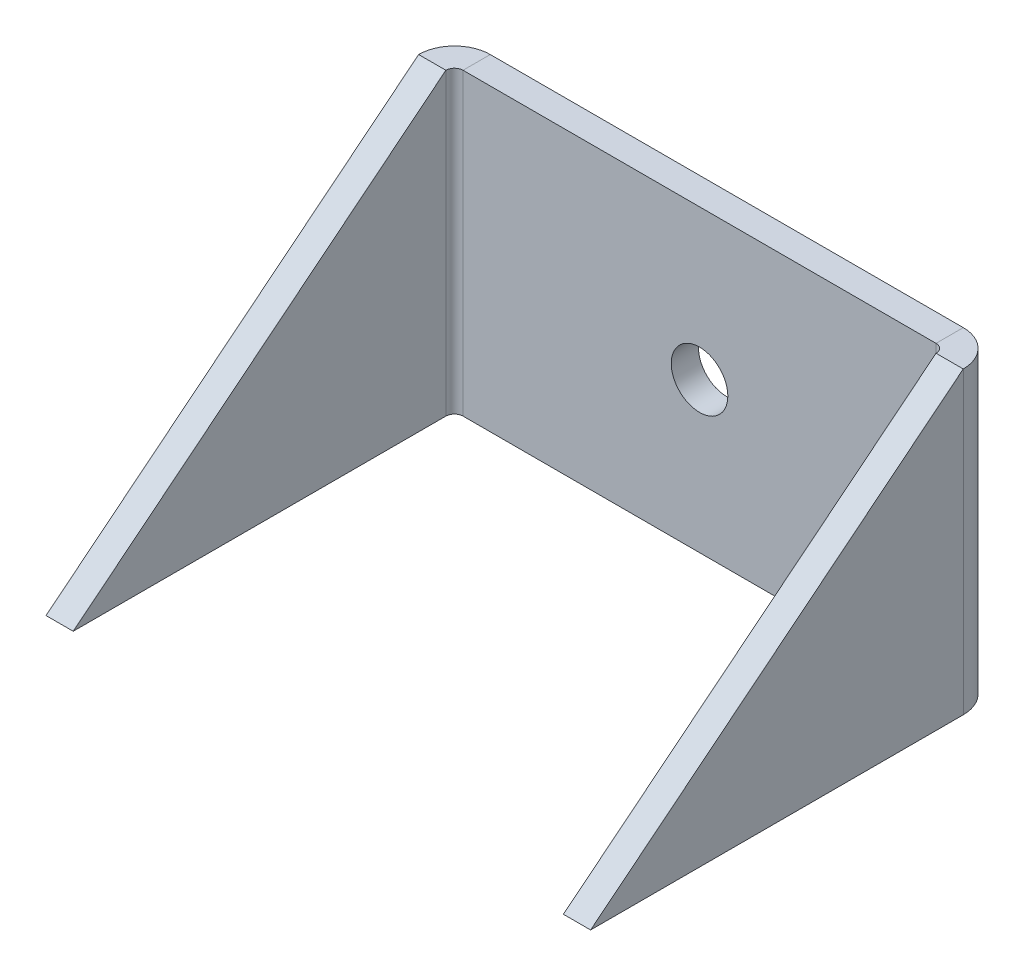
ISO-10303-21;
HEADER;
FILE_DESCRIPTION(('STEP AP214'),'2;1');
FILE_NAME('part.step','',(''),(''),'','','');
FILE_SCHEMA(('AUTOMOTIVE_DESIGN { 1 0 10303 214 1 1 1 1 }'));
ENDSEC;
DATA;
#1=APPLICATION_CONTEXT('core data for automotive mechanical design processes');
#2=APPLICATION_PROTOCOL_DEFINITION('international standard','automotive_design',2000,#1);
#3=PRODUCT_CONTEXT('',#1,'mechanical');
#4=PRODUCT('Part','Part','',(#3));
#5=PRODUCT_RELATED_PRODUCT_CATEGORY('part','',(#4));
#6=PRODUCT_DEFINITION_FORMATION('','',#4);
#7=PRODUCT_DEFINITION_CONTEXT('part definition',#1,'design');
#8=PRODUCT_DEFINITION('design','',#6,#7);
#9=PRODUCT_DEFINITION_SHAPE('','',#8);
#10=(LENGTH_UNIT() NAMED_UNIT(*) SI_UNIT(.MILLI.,.METRE.));
#11=(NAMED_UNIT(*) PLANE_ANGLE_UNIT() SI_UNIT($,.RADIAN.));
#12=(NAMED_UNIT(*) SI_UNIT($,.STERADIAN.) SOLID_ANGLE_UNIT());
#13=UNCERTAINTY_MEASURE_WITH_UNIT(LENGTH_MEASURE(1.E-05),#10,'distance_accuracy_value','');
#14=(GEOMETRIC_REPRESENTATION_CONTEXT(3) GLOBAL_UNCERTAINTY_ASSIGNED_CONTEXT((#13)) GLOBAL_UNIT_ASSIGNED_CONTEXT((#10,
#11,#12)) REPRESENTATION_CONTEXT('',''));
#15=CARTESIAN_POINT('',(0.,0.,0.));
#16=DIRECTION('',(0.,0.,1.));
#17=DIRECTION('',(1.,0.,0.));
#18=AXIS2_PLACEMENT_3D('',#15,#16,#17);
#19=CARTESIAN_POINT('',(-31.75,0.,-1.11451597218056E-13));
#20=DIRECTION('',(1.,0.,0.));
#21=DIRECTION('',(0.,0.,1.));
#22=AXIS2_PLACEMENT_3D('',#19,#20,#21);
#23=PLANE('',#22);
#24=DIRECTION('',(0.,0.626498155753381,-0.77942290243334));
#25=VECTOR('',#24,1.);
#26=CARTESIAN_POINT('',(-31.75,17.4625,4.17499999999998));
#27=LINE('',#26,#25);
#28=CARTESIAN_POINT('',(-31.7500000000002,-17.4625,47.625));
#29=VERTEX_POINT('',#28);
#30=CARTESIAN_POINT('',(-31.75,17.4625,4.17499999999998));
#31=VERTEX_POINT('',#30);
#32=EDGE_CURVE('E128',#29,#31,#27,.T.);
#33=ORIENTED_EDGE('',*,*,#32,.T.);
#34=DIRECTION('',(0.,1.,0.));
#35=VECTOR('',#34,1.);
#36=CARTESIAN_POINT('',(-31.75,0.,4.17499999999998));
#37=LINE('',#36,#35);
#38=CARTESIAN_POINT('',(-31.75,-17.4625,4.17499999999999));
#39=VERTEX_POINT('',#38);
#40=EDGE_CURVE('E151',#39,#31,#37,.T.);
#41=ORIENTED_EDGE('',*,*,#40,.F.);
#42=DIRECTION('',(0.,0.,-1.));
#43=VECTOR('',#42,1.);
#44=CARTESIAN_POINT('',(-31.75,-17.4625,3.17499999999999));
#45=LINE('',#44,#43);
#46=EDGE_CURVE('E157',#29,#39,#45,.T.);
#47=ORIENTED_EDGE('',*,*,#46,.F.);
#48=EDGE_LOOP('',(#33,#41,#47));
#49=FACE_BOUND('',#48,.T.);
#50=ADVANCED_FACE('F38',(#49),#23,.F.);
#51=CARTESIAN_POINT('',(-28.575,0.,-1.00366143967229E-13));
#52=DIRECTION('',(1.,0.,0.));
#53=DIRECTION('',(0.,0.,1.));
#54=AXIS2_PLACEMENT_3D('',#51,#52,#53);
#55=PLANE('',#54);
#56=DIRECTION('',(0.,-1.,0.));
#57=VECTOR('',#56,1.);
#58=CARTESIAN_POINT('',(-28.575,17.4625,4.17499999999999));
#59=LINE('',#58,#57);
#60=CARTESIAN_POINT('',(-28.575,17.4625,4.17499999999999));
#61=VERTEX_POINT('',#60);
#62=CARTESIAN_POINT('',(-28.575,-17.4625,4.175));
#63=VERTEX_POINT('',#62);
#64=EDGE_CURVE('E138',#61,#63,#59,.T.);
#65=ORIENTED_EDGE('',*,*,#64,.F.);
#66=DIRECTION('',(0.,0.626498155753381,-0.77942290243334));
#67=VECTOR('',#66,1.);
#68=CARTESIAN_POINT('',(-28.575,17.4625,4.17499999999999));
#69=LINE('',#68,#67);
#70=CARTESIAN_POINT('',(-28.5750000000001,-17.4625,47.625));
#71=VERTEX_POINT('',#70);
#72=EDGE_CURVE('E117',#71,#61,#69,.T.);
#73=ORIENTED_EDGE('',*,*,#72,.F.);
#74=DIRECTION('',(0.,0.,-1.));
#75=VECTOR('',#74,1.);
#76=CARTESIAN_POINT('',(-28.575,-17.4625,3.175));
#77=LINE('',#76,#75);
#78=EDGE_CURVE('E147',#71,#63,#77,.T.);
#79=ORIENTED_EDGE('',*,*,#78,.T.);
#80=EDGE_LOOP('',(#65,#73,#79));
#81=FACE_BOUND('',#80,.T.);
#82=ADVANCED_FACE('F146',(#81),#55,.T.);
#83=CARTESIAN_POINT('',(-28.575,17.4625,3.175));
#84=DIRECTION('',(0.,-1.,0.));
#85=DIRECTION('',(0.,0.,-1.));
#86=AXIS2_PLACEMENT_3D('',#83,#84,#85);
#87=PLANE('',#86);
#88=DIRECTION('',(0.,0.,-1.));
#89=VECTOR('',#88,1.);
#90=CARTESIAN_POINT('',(-27.575,17.4625,3.175));
#91=LINE('',#90,#89);
#92=CARTESIAN_POINT('',(-27.575,17.4625,3.175));
#93=VERTEX_POINT('',#92);
#94=CARTESIAN_POINT('',(-27.575,17.4625,0.));
#95=VERTEX_POINT('',#94);
#96=EDGE_CURVE('E55',#93,#95,#91,.T.);
#97=ORIENTED_EDGE('',*,*,#96,.F.);
#98=DIRECTION('',(-1.,0.,0.));
#99=VECTOR('',#98,1.);
#100=CARTESIAN_POINT('',(-28.575,17.4625,3.175));
#101=LINE('',#100,#99);
#102=CARTESIAN_POINT('',(27.575,17.4625,3.175));
#103=VERTEX_POINT('',#102);
#104=EDGE_CURVE('E47',#103,#93,#101,.T.);
#105=ORIENTED_EDGE('',*,*,#104,.F.);
#106=DIRECTION('',(0.,0.,-1.));
#107=VECTOR('',#106,1.);
#108=CARTESIAN_POINT('',(27.575,17.4625,3.17499999999999));
#109=LINE('',#108,#107);
#110=CARTESIAN_POINT('',(27.575,17.4625,0.));
#111=VERTEX_POINT('',#110);
#112=EDGE_CURVE('E206',#103,#111,#109,.T.);
#113=ORIENTED_EDGE('',*,*,#112,.T.);
#114=DIRECTION('',(-1.,0.,0.));
#115=VECTOR('',#114,1.);
#116=CARTESIAN_POINT('',(-28.575,17.4625,0.));
#117=LINE('',#116,#115);
#118=EDGE_CURVE('E220',#111,#95,#117,.T.);
#119=ORIENTED_EDGE('',*,*,#118,.T.);
#120=EDGE_LOOP('',(#97,#105,#113,#119));
#121=FACE_BOUND('',#120,.T.);
#122=ADVANCED_FACE('F40',(#121),#87,.F.);
#123=CARTESIAN_POINT('',(-28.575,-17.4625,3.175));
#124=DIRECTION('',(0.,1.,0.));
#125=DIRECTION('',(0.,0.,1.));
#126=AXIS2_PLACEMENT_3D('',#123,#124,#125);
#127=PLANE('',#126);
#128=DIRECTION('',(0.,0.,-1.));
#129=VECTOR('',#128,1.);
#130=CARTESIAN_POINT('',(-27.575,-17.4625,3.175));
#131=LINE('',#130,#129);
#132=CARTESIAN_POINT('',(-27.575,-17.4625,3.175));
#133=VERTEX_POINT('',#132);
#134=CARTESIAN_POINT('',(-27.575,-17.4625,0.));
#135=VERTEX_POINT('',#134);
#136=EDGE_CURVE('E166',#133,#135,#131,.T.);
#137=ORIENTED_EDGE('',*,*,#136,.T.);
#138=DIRECTION('',(1.,0.,0.));
#139=VECTOR('',#138,1.);
#140=CARTESIAN_POINT('',(-28.575,-17.4625,0.));
#141=LINE('',#140,#139);
#142=CARTESIAN_POINT('',(27.575,-17.4625,0.));
#143=VERTEX_POINT('',#142);
#144=EDGE_CURVE('E42',#135,#143,#141,.T.);
#145=ORIENTED_EDGE('',*,*,#144,.T.);
#146=DIRECTION('',(0.,0.,-1.));
#147=VECTOR('',#146,1.);
#148=CARTESIAN_POINT('',(27.575,-17.4625,3.17499999999999));
#149=LINE('',#148,#147);
#150=CARTESIAN_POINT('',(27.575,-17.4625,3.175));
#151=VERTEX_POINT('',#150);
#152=EDGE_CURVE('E217',#151,#143,#149,.T.);
#153=ORIENTED_EDGE('',*,*,#152,.F.);
#154=DIRECTION('',(1.,0.,0.));
#155=VECTOR('',#154,1.);
#156=CARTESIAN_POINT('',(-28.575,-17.4625,3.175));
#157=LINE('',#156,#155);
#158=EDGE_CURVE('E11',#133,#151,#157,.T.);
#159=ORIENTED_EDGE('',*,*,#158,.F.);
#160=EDGE_LOOP('',(#137,#145,#153,#159));
#161=FACE_BOUND('',#160,.T.);
#162=ADVANCED_FACE('F226',(#161),#127,.F.);
#163=CARTESIAN_POINT('',(0.,0.,3.175));
#164=DIRECTION('',(0.,0.,1.));
#165=DIRECTION('',(1.,0.,0.));
#166=AXIS2_PLACEMENT_3D('',#163,#164,#165);
#167=PLANE('',#166);
#168=CARTESIAN_POINT('',(0.,0.,3.175));
#169=DIRECTION('',(0.,0.,1.));
#170=DIRECTION('',(1.,0.,0.));
#171=AXIS2_PLACEMENT_3D('',#168,#169,#170);
#172=CIRCLE('',#171,3.29999999999999);
#173=CARTESIAN_POINT('',(3.29999999999999,0.,3.175));
#174=VERTEX_POINT('',#173);
#175=EDGE_CURVE('E296',#174,#174,#172,.T.);
#176=ORIENTED_EDGE('',*,*,#175,.F.);
#177=EDGE_LOOP('',(#176));
#178=FACE_BOUND('',#177,.T.);
#179=ORIENTED_EDGE('',*,*,#104,.T.);
#180=DIRECTION('',(0.,-1.,0.));
#181=VECTOR('',#180,1.);
#182=CARTESIAN_POINT('',(-27.575,-17.4625,3.175));
#183=LINE('',#182,#181);
#184=EDGE_CURVE('E61',#133,#93,#183,.F.);
#185=ORIENTED_EDGE('',*,*,#184,.F.);
#186=ORIENTED_EDGE('',*,*,#158,.T.);
#187=DIRECTION('',(0.,1.,0.));
#188=VECTOR('',#187,1.);
#189=CARTESIAN_POINT('',(27.575,17.4625,3.17499999999999));
#190=LINE('',#189,#188);
#191=EDGE_CURVE('E212',#103,#151,#190,.F.);
#192=ORIENTED_EDGE('',*,*,#191,.F.);
#193=EDGE_LOOP('',(#179,#185,#186,#192));
#194=FACE_BOUND('',#193,.T.);
#195=ADVANCED_FACE('F258',(#178,#194),#167,.T.);
#196=CARTESIAN_POINT('',(0.,0.,0.));
#197=DIRECTION('',(0.,0.,1.));
#198=DIRECTION('',(1.,0.,0.));
#199=AXIS2_PLACEMENT_3D('',#196,#197,#198);
#200=PLANE('',#199);
#201=CARTESIAN_POINT('',(0.,0.,0.));
#202=DIRECTION('',(0.,0.,1.));
#203=DIRECTION('',(1.,0.,0.));
#204=AXIS2_PLACEMENT_3D('',#201,#202,#203);
#205=CIRCLE('',#204,3.3);
#206=CARTESIAN_POINT('',(3.3,0.,0.));
#207=VERTEX_POINT('',#206);
#208=EDGE_CURVE('E293',#207,#207,#205,.T.);
#209=ORIENTED_EDGE('',*,*,#208,.T.);
#210=EDGE_LOOP('',(#209));
#211=FACE_BOUND('',#210,.T.);
#212=DIRECTION('',(0.,-1.,0.));
#213=VECTOR('',#212,1.);
#214=CARTESIAN_POINT('',(-27.575,-17.4625,0.));
#215=LINE('',#214,#213);
#216=EDGE_CURVE('E163',#135,#95,#215,.F.);
#217=ORIENTED_EDGE('',*,*,#216,.T.);
#218=ORIENTED_EDGE('',*,*,#118,.F.);
#219=DIRECTION('',(0.,1.,0.));
#220=VECTOR('',#219,1.);
#221=CARTESIAN_POINT('',(27.575,17.4625,0.));
#222=LINE('',#221,#220);
#223=EDGE_CURVE('E199',#111,#143,#222,.F.);
#224=ORIENTED_EDGE('',*,*,#223,.T.);
#225=ORIENTED_EDGE('',*,*,#144,.F.);
#226=EDGE_LOOP('',(#217,#218,#224,#225));
#227=FACE_BOUND('',#226,.T.);
#228=ADVANCED_FACE('F231',(#211,#227),#200,.F.);
#229=CARTESIAN_POINT('',(27.575,-17.4625,4.175));
#230=DIRECTION('',(0.,-1.,0.));
#231=DIRECTION('',(0.,0.,-1.));
#232=AXIS2_PLACEMENT_3D('',#229,#230,#231);
#233=PLANE('',#232);
#234=DIRECTION('',(1.,0.,0.));
#235=VECTOR('',#234,1.);
#236=CARTESIAN_POINT('',(28.575,-17.4625,4.17499999999999));
#237=LINE('',#236,#235);
#238=CARTESIAN_POINT('',(28.575,-17.4625,4.17499999999999));
#239=VERTEX_POINT('',#238);
#240=CARTESIAN_POINT('',(31.75,-17.4625,4.17499999999998));
#241=VERTEX_POINT('',#240);
#242=EDGE_CURVE('E177',#239,#241,#237,.T.);
#243=ORIENTED_EDGE('',*,*,#242,.F.);
#244=CARTESIAN_POINT('',(27.575,-17.4625,4.175));
#245=DIRECTION('',(0.,1.,0.));
#246=DIRECTION('',(0.,0.,1.));
#247=AXIS2_PLACEMENT_3D('',#244,#245,#246);
#248=CIRCLE('',#247,1.);
#249=EDGE_CURVE('E209',#151,#239,#248,.F.);
#250=ORIENTED_EDGE('',*,*,#249,.F.);
#251=ORIENTED_EDGE('',*,*,#152,.T.);
#252=CARTESIAN_POINT('',(27.575,-17.4625,4.175));
#253=DIRECTION('',(0.,1.,0.));
#254=DIRECTION('',(0.,0.,1.));
#255=AXIS2_PLACEMENT_3D('',#252,#253,#254);
#256=CIRCLE('',#255,4.175);
#257=EDGE_CURVE('E202',#143,#241,#256,.F.);
#258=ORIENTED_EDGE('',*,*,#257,.T.);
#259=EDGE_LOOP('',(#243,#250,#251,#258));
#260=FACE_BOUND('',#259,.T.);
#261=ADVANCED_FACE('F237',(#260),#233,.T.);
#262=CARTESIAN_POINT('',(27.575,17.4625,4.175));
#263=DIRECTION('',(0.,-1.,0.));
#264=DIRECTION('',(0.,0.,-1.));
#265=AXIS2_PLACEMENT_3D('',#262,#263,#264);
#266=PLANE('',#265);
#267=CARTESIAN_POINT('',(27.575,17.4625,4.175));
#268=DIRECTION('',(0.,1.,0.));
#269=DIRECTION('',(0.,0.,1.));
#270=AXIS2_PLACEMENT_3D('',#267,#268,#269);
#271=CIRCLE('',#270,1.);
#272=CARTESIAN_POINT('',(28.575,17.4625,4.17499999999999));
#273=VERTEX_POINT('',#272);
#274=EDGE_CURVE('E198',#273,#103,#271,.T.);
#275=ORIENTED_EDGE('',*,*,#274,.F.);
#276=DIRECTION('',(1.,0.,0.));
#277=VECTOR('',#276,1.);
#278=CARTESIAN_POINT('',(28.575,17.4625,4.17499999999999));
#279=LINE('',#278,#277);
#280=CARTESIAN_POINT('',(31.75,17.4625,4.17499999999998));
#281=VERTEX_POINT('',#280);
#282=EDGE_CURVE('E182',#273,#281,#279,.T.);
#283=ORIENTED_EDGE('',*,*,#282,.T.);
#284=CARTESIAN_POINT('',(27.575,17.4625,4.175));
#285=DIRECTION('',(0.,1.,0.));
#286=DIRECTION('',(0.,0.,1.));
#287=AXIS2_PLACEMENT_3D('',#284,#285,#286);
#288=CIRCLE('',#287,4.175);
#289=EDGE_CURVE('E203',#281,#111,#288,.T.);
#290=ORIENTED_EDGE('',*,*,#289,.T.);
#291=ORIENTED_EDGE('',*,*,#112,.F.);
#292=EDGE_LOOP('',(#275,#283,#290,#291));
#293=FACE_BOUND('',#292,.T.);
#294=ADVANCED_FACE('F256',(#293),#266,.F.);
#295=CARTESIAN_POINT('',(27.575,17.4625,4.175));
#296=DIRECTION('',(0.,1.,0.));
#297=DIRECTION('',(1.,0.,0.));
#298=AXIS2_PLACEMENT_3D('',#295,#296,#297);
#299=CYLINDRICAL_SURFACE('',#298,4.175);
#300=ORIENTED_EDGE('',*,*,#223,.F.);
#301=ORIENTED_EDGE('',*,*,#289,.F.);
#302=DIRECTION('',(0.,-1.,0.));
#303=VECTOR('',#302,1.);
#304=CARTESIAN_POINT('',(31.75,0.,4.17499999999998));
#305=LINE('',#304,#303);
#306=EDGE_CURVE('E185',#281,#241,#305,.T.);
#307=ORIENTED_EDGE('',*,*,#306,.T.);
#308=ORIENTED_EDGE('',*,*,#257,.F.);
#309=EDGE_LOOP('',(#300,#301,#307,#308));
#310=FACE_BOUND('',#309,.T.);
#311=ADVANCED_FACE('F238',(#310),#299,.T.);
#312=CARTESIAN_POINT('',(27.575,17.4625,4.175));
#313=DIRECTION('',(0.,1.,0.));
#314=DIRECTION('',(1.,0.,0.));
#315=AXIS2_PLACEMENT_3D('',#312,#313,#314);
#316=CYLINDRICAL_SURFACE('',#315,1.);
#317=ORIENTED_EDGE('',*,*,#191,.T.);
#318=ORIENTED_EDGE('',*,*,#249,.T.);
#319=DIRECTION('',(0.,1.,0.));
#320=VECTOR('',#319,1.);
#321=CARTESIAN_POINT('',(28.575,-17.4625,4.17499999999999));
#322=LINE('',#321,#320);
#323=EDGE_CURVE('E179',#239,#273,#322,.T.);
#324=ORIENTED_EDGE('',*,*,#323,.T.);
#325=ORIENTED_EDGE('',*,*,#274,.T.);
#326=EDGE_LOOP('',(#317,#318,#324,#325));
#327=FACE_BOUND('',#326,.T.);
#328=ADVANCED_FACE('F249',(#327),#316,.F.);
#329=CARTESIAN_POINT('',(31.75,-17.4625,3.17499999999999));
#330=DIRECTION('',(0.,1.,0.));
#331=DIRECTION('',(-1.,0.,0.));
#332=AXIS2_PLACEMENT_3D('',#329,#330,#331);
#333=PLANE('',#332);
#334=ORIENTED_EDGE('',*,*,#242,.T.);
#335=DIRECTION('',(0.,0.,-1.));
#336=VECTOR('',#335,1.);
#337=CARTESIAN_POINT('',(31.75,-17.4625,3.17499999999999));
#338=LINE('',#337,#336);
#339=CARTESIAN_POINT('',(31.7500000000001,-17.4625,47.625));
#340=VERTEX_POINT('',#339);
#341=EDGE_CURVE('E190',#340,#241,#338,.T.);
#342=ORIENTED_EDGE('',*,*,#341,.F.);
#343=DIRECTION('',(-1.,0.,0.));
#344=VECTOR('',#343,1.);
#345=CARTESIAN_POINT('',(31.7500000000002,-17.4625,47.625));
#346=LINE('',#345,#344);
#347=CARTESIAN_POINT('',(28.5750000000002,-17.4625,47.625));
#348=VERTEX_POINT('',#347);
#349=EDGE_CURVE('E193',#340,#348,#346,.T.);
#350=ORIENTED_EDGE('',*,*,#349,.T.);
#351=DIRECTION('',(0.,0.,-1.));
#352=VECTOR('',#351,1.);
#353=CARTESIAN_POINT('',(28.575,-17.4625,3.175));
#354=LINE('',#353,#352);
#355=EDGE_CURVE('E189',#348,#239,#354,.T.);
#356=ORIENTED_EDGE('',*,*,#355,.T.);
#357=EDGE_LOOP('',(#334,#342,#350,#356));
#358=FACE_BOUND('',#357,.T.);
#359=ADVANCED_FACE('F245',(#358),#333,.F.);
#360=CARTESIAN_POINT('',(31.75,0.,-1.11451597218056E-13));
#361=DIRECTION('',(-1.,0.,0.));
#362=DIRECTION('',(0.,0.,1.));
#363=AXIS2_PLACEMENT_3D('',#360,#361,#362);
#364=PLANE('',#363);
#365=ORIENTED_EDGE('',*,*,#306,.F.);
#366=DIRECTION('',(0.,0.626498155753381,-0.77942290243334));
#367=VECTOR('',#366,1.);
#368=CARTESIAN_POINT('',(31.75,17.4625,4.17499999999998));
#369=LINE('',#368,#367);
#370=EDGE_CURVE('E172',#340,#281,#369,.T.);
#371=ORIENTED_EDGE('',*,*,#370,.F.);
#372=ORIENTED_EDGE('',*,*,#341,.T.);
#373=EDGE_LOOP('',(#365,#371,#372));
#374=FACE_BOUND('',#373,.T.);
#375=ADVANCED_FACE('F242',(#374),#364,.F.);
#376=CARTESIAN_POINT('',(28.575,0.,-1.00366143967229E-13));
#377=DIRECTION('',(-1.,0.,0.));
#378=DIRECTION('',(0.,0.,1.));
#379=AXIS2_PLACEMENT_3D('',#376,#377,#378);
#380=PLANE('',#379);
#381=DIRECTION('',(0.,0.626498155753381,-0.77942290243334));
#382=VECTOR('',#381,1.);
#383=CARTESIAN_POINT('',(28.575,17.4625,4.17499999999999));
#384=LINE('',#383,#382);
#385=EDGE_CURVE('E174',#348,#273,#384,.T.);
#386=ORIENTED_EDGE('',*,*,#385,.T.);
#387=ORIENTED_EDGE('',*,*,#323,.F.);
#388=ORIENTED_EDGE('',*,*,#355,.F.);
#389=EDGE_LOOP('',(#386,#387,#388));
#390=FACE_BOUND('',#389,.T.);
#391=ADVANCED_FACE('F252',(#390),#380,.T.);
#392=CARTESIAN_POINT('',(28.575,17.4625,4.17499999999999));
#393=DIRECTION('',(0.,-0.77942290243334,-0.626498155753381));
#394=DIRECTION('',(0.,0.626498155753381,-0.779422902433341));
#395=AXIS2_PLACEMENT_3D('',#392,#393,#394);
#396=PLANE('',#395);
#397=ORIENTED_EDGE('',*,*,#370,.T.);
#398=ORIENTED_EDGE('',*,*,#282,.F.);
#399=ORIENTED_EDGE('',*,*,#385,.F.);
#400=ORIENTED_EDGE('',*,*,#349,.F.);
#401=EDGE_LOOP('',(#397,#398,#399,#400));
#402=FACE_BOUND('',#401,.T.);
#403=ADVANCED_FACE('F254',(#402),#396,.F.);
#404=CARTESIAN_POINT('',(-27.575,17.4625,4.175));
#405=DIRECTION('',(0.,1.,0.));
#406=DIRECTION('',(0.,0.,1.));
#407=AXIS2_PLACEMENT_3D('',#404,#405,#406);
#408=PLANE('',#407);
#409=DIRECTION('',(-1.,0.,0.));
#410=VECTOR('',#409,1.);
#411=CARTESIAN_POINT('',(-28.575,17.4625,4.17499999999999));
#412=LINE('',#411,#410);
#413=EDGE_CURVE('E120',#61,#31,#412,.T.);
#414=ORIENTED_EDGE('',*,*,#413,.F.);
#415=CARTESIAN_POINT('',(-27.575,17.4625,4.175));
#416=DIRECTION('',(0.,-1.,0.));
#417=DIRECTION('',(0.,0.,-1.));
#418=AXIS2_PLACEMENT_3D('',#415,#416,#417);
#419=CIRCLE('',#418,0.999999999999997);
#420=EDGE_CURVE('E135',#93,#61,#419,.F.);
#421=ORIENTED_EDGE('',*,*,#420,.F.);
#422=ORIENTED_EDGE('',*,*,#96,.T.);
#423=CARTESIAN_POINT('',(-27.575,17.4625,4.175));
#424=DIRECTION('',(0.,-1.,0.));
#425=DIRECTION('',(0.,0.,-1.));
#426=AXIS2_PLACEMENT_3D('',#423,#424,#425);
#427=CIRCLE('',#426,4.175);
#428=EDGE_CURVE('E137',#95,#31,#427,.F.);
#429=ORIENTED_EDGE('',*,*,#428,.T.);
#430=EDGE_LOOP('',(#414,#421,#422,#429));
#431=FACE_BOUND('',#430,.T.);
#432=ADVANCED_FACE('F134',(#431),#408,.T.);
#433=CARTESIAN_POINT('',(-27.575,-17.4625,4.175));
#434=DIRECTION('',(0.,1.,0.));
#435=DIRECTION('',(0.,0.,1.));
#436=AXIS2_PLACEMENT_3D('',#433,#434,#435);
#437=PLANE('',#436);
#438=CARTESIAN_POINT('',(-27.575,-17.4625,4.175));
#439=DIRECTION('',(0.,-1.,0.));
#440=DIRECTION('',(0.,0.,-1.));
#441=AXIS2_PLACEMENT_3D('',#438,#439,#440);
#442=CIRCLE('',#441,0.999999999999997);
#443=EDGE_CURVE('E162',#63,#133,#442,.T.);
#444=ORIENTED_EDGE('',*,*,#443,.F.);
#445=DIRECTION('',(-1.,0.,0.));
#446=VECTOR('',#445,1.);
#447=CARTESIAN_POINT('',(-28.575,-17.4625,4.175));
#448=LINE('',#447,#446);
#449=EDGE_CURVE('E148',#63,#39,#448,.T.);
#450=ORIENTED_EDGE('',*,*,#449,.T.);
#451=CARTESIAN_POINT('',(-27.575,-17.4625,4.175));
#452=DIRECTION('',(0.,-1.,0.));
#453=DIRECTION('',(0.,0.,-1.));
#454=AXIS2_PLACEMENT_3D('',#451,#452,#453);
#455=CIRCLE('',#454,4.175);
#456=EDGE_CURVE('E144',#39,#135,#455,.T.);
#457=ORIENTED_EDGE('',*,*,#456,.T.);
#458=ORIENTED_EDGE('',*,*,#136,.F.);
#459=EDGE_LOOP('',(#444,#450,#457,#458));
#460=FACE_BOUND('',#459,.T.);
#461=ADVANCED_FACE('F260',(#460),#437,.F.);
#462=CARTESIAN_POINT('',(-27.575,-17.4625,4.175));
#463=DIRECTION('',(0.,-1.,0.));
#464=DIRECTION('',(-1.,0.,0.));
#465=AXIS2_PLACEMENT_3D('',#462,#463,#464);
#466=CYLINDRICAL_SURFACE('',#465,4.175);
#467=ORIENTED_EDGE('',*,*,#216,.F.);
#468=ORIENTED_EDGE('',*,*,#456,.F.);
#469=ORIENTED_EDGE('',*,*,#40,.T.);
#470=ORIENTED_EDGE('',*,*,#428,.F.);
#471=EDGE_LOOP('',(#467,#468,#469,#470));
#472=FACE_BOUND('',#471,.T.);
#473=ADVANCED_FACE('F264',(#472),#466,.T.);
#474=CARTESIAN_POINT('',(-27.575,-17.4625,4.175));
#475=DIRECTION('',(0.,-1.,0.));
#476=DIRECTION('',(-1.,0.,0.));
#477=AXIS2_PLACEMENT_3D('',#474,#475,#476);
#478=CYLINDRICAL_SURFACE('',#477,0.999999999999997);
#479=ORIENTED_EDGE('',*,*,#184,.T.);
#480=ORIENTED_EDGE('',*,*,#420,.T.);
#481=ORIENTED_EDGE('',*,*,#64,.T.);
#482=ORIENTED_EDGE('',*,*,#443,.T.);
#483=EDGE_LOOP('',(#479,#480,#481,#482));
#484=FACE_BOUND('',#483,.T.);
#485=ADVANCED_FACE('F141',(#484),#478,.F.);
#486=CARTESIAN_POINT('',(-31.75,-17.4625,3.17499999999999));
#487=DIRECTION('',(0.,-1.,0.));
#488=DIRECTION('',(1.,0.,0.));
#489=AXIS2_PLACEMENT_3D('',#486,#487,#488);
#490=PLANE('',#489);
#491=ORIENTED_EDGE('',*,*,#46,.T.);
#492=ORIENTED_EDGE('',*,*,#449,.F.);
#493=ORIENTED_EDGE('',*,*,#78,.F.);
#494=DIRECTION('',(1.,0.,0.));
#495=VECTOR('',#494,1.);
#496=CARTESIAN_POINT('',(-31.7500000000002,-17.4625,47.625));
#497=LINE('',#496,#495);
#498=EDGE_CURVE('E123',#29,#71,#497,.T.);
#499=ORIENTED_EDGE('',*,*,#498,.F.);
#500=EDGE_LOOP('',(#491,#492,#493,#499));
#501=FACE_BOUND('',#500,.T.);
#502=ADVANCED_FACE('F268',(#501),#490,.T.);
#503=CARTESIAN_POINT('',(-28.575,17.4625,4.17499999999999));
#504=DIRECTION('',(0.,0.77942290243334,0.626498155753381));
#505=DIRECTION('',(0.,-0.626498155753381,0.779422902433341));
#506=AXIS2_PLACEMENT_3D('',#503,#504,#505);
#507=PLANE('',#506);
#508=ORIENTED_EDGE('',*,*,#32,.F.);
#509=ORIENTED_EDGE('',*,*,#498,.T.);
#510=ORIENTED_EDGE('',*,*,#72,.T.);
#511=ORIENTED_EDGE('',*,*,#413,.T.);
#512=EDGE_LOOP('',(#508,#509,#510,#511));
#513=FACE_BOUND('',#512,.T.);
#514=ADVANCED_FACE('F119',(#513),#507,.T.);
#515=CARTESIAN_POINT('',(0.,0.,3.175));
#516=DIRECTION('',(0.,0.,1.));
#517=DIRECTION('',(1.,0.,0.));
#518=AXIS2_PLACEMENT_3D('',#515,#516,#517);
#519=CYLINDRICAL_SURFACE('',#518,3.29999999999999);
#520=ORIENTED_EDGE('',*,*,#208,.F.);
#521=EDGE_LOOP('',(#520));
#522=FACE_BOUND('',#521,.T.);
#523=ORIENTED_EDGE('',*,*,#175,.T.);
#524=EDGE_LOOP('',(#523));
#525=FACE_BOUND('',#524,.T.);
#526=ADVANCED_FACE('F275',(#522,#525),#519,.F.);
#527=CLOSED_SHELL('',(#50,#82,#122,#162,#195,#228,#261,#294,#311,#328,#359,#375,#391,#403,#432,
#461,#473,#485,#502,#514,#526));
#528=MANIFOLD_SOLID_BREP('B2',#527);
#529=ADVANCED_BREP_SHAPE_REPRESENTATION('',(#18,#528),#14);
#530=SHAPE_DEFINITION_REPRESENTATION(#9,#529);
ENDSEC;
END-ISO-10303-21;
